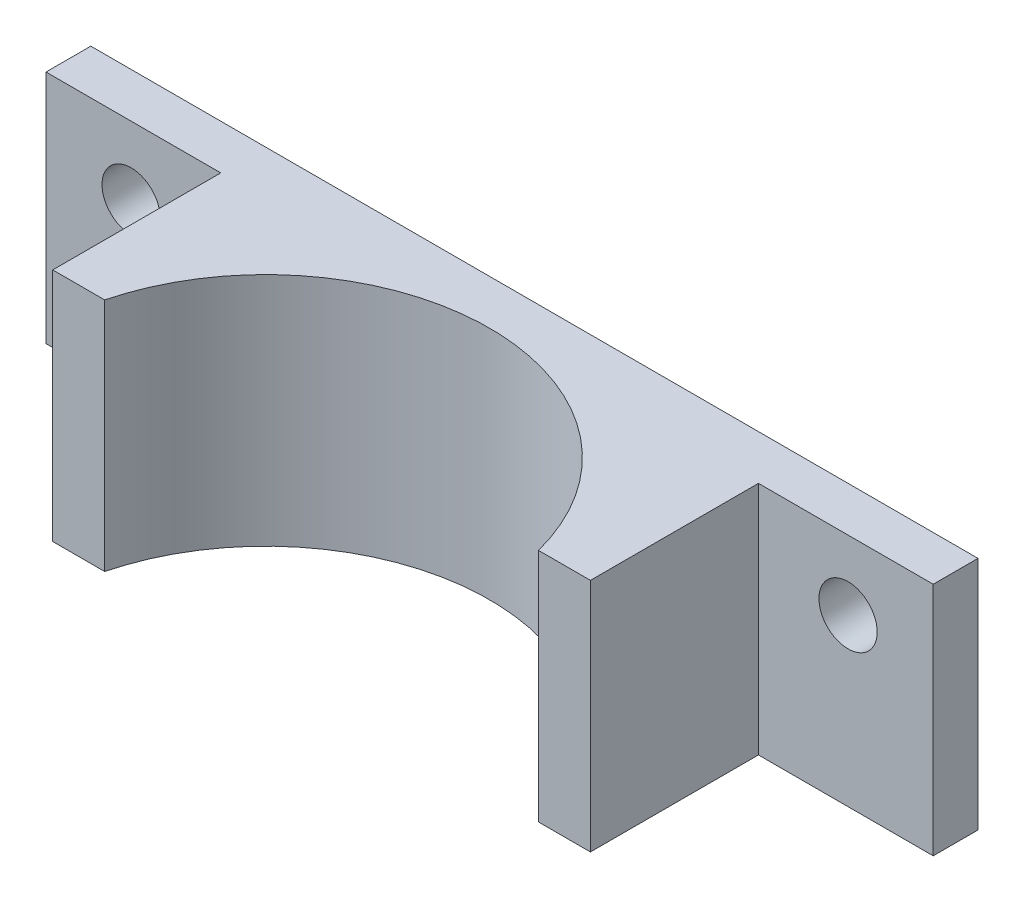
ISO-10303-21;
HEADER;
FILE_DESCRIPTION(('STEP AP214'),'2;1');
FILE_NAME('part.step','',(''),(''),'','','');
FILE_SCHEMA(('AUTOMOTIVE_DESIGN { 1 0 10303 214 1 1 1 1 }'));
ENDSEC;
DATA;
#1=APPLICATION_CONTEXT('core data for automotive mechanical design processes');
#2=APPLICATION_PROTOCOL_DEFINITION('international standard','automotive_design',2000,#1);
#3=PRODUCT_CONTEXT('',#1,'mechanical');
#4=PRODUCT('Part','Part','',(#3));
#5=PRODUCT_RELATED_PRODUCT_CATEGORY('part','',(#4));
#6=PRODUCT_DEFINITION_FORMATION('','',#4);
#7=PRODUCT_DEFINITION_CONTEXT('part definition',#1,'design');
#8=PRODUCT_DEFINITION('design','',#6,#7);
#9=PRODUCT_DEFINITION_SHAPE('','',#8);
#10=(LENGTH_UNIT() NAMED_UNIT(*) SI_UNIT(.MILLI.,.METRE.));
#11=(NAMED_UNIT(*) PLANE_ANGLE_UNIT() SI_UNIT($,.RADIAN.));
#12=(NAMED_UNIT(*) SI_UNIT($,.STERADIAN.) SOLID_ANGLE_UNIT());
#13=UNCERTAINTY_MEASURE_WITH_UNIT(LENGTH_MEASURE(1.E-05),#10,'distance_accuracy_value','');
#14=(GEOMETRIC_REPRESENTATION_CONTEXT(3) GLOBAL_UNCERTAINTY_ASSIGNED_CONTEXT((#13)) GLOBAL_UNIT_ASSIGNED_CONTEXT((#10,
#11,#12)) REPRESENTATION_CONTEXT('',''));
#15=CARTESIAN_POINT('',(0.,0.,0.));
#16=DIRECTION('',(0.,0.,1.));
#17=DIRECTION('',(1.,0.,0.));
#18=AXIS2_PLACEMENT_3D('',#15,#16,#17);
#19=CARTESIAN_POINT('',(0.,0.,24.13));
#20=DIRECTION('',(0.,0.,1.));
#21=DIRECTION('',(1.,0.,0.));
#22=AXIS2_PLACEMENT_3D('',#19,#20,#21);
#23=PLANE('',#22);
#24=DIRECTION('',(-1.,0.,0.));
#25=VECTOR('',#24,1.);
#26=CARTESIAN_POINT('',(0.,1.92935920302377,24.13));
#27=LINE('',#26,#25);
#28=CARTESIAN_POINT('',(-34.5714503107594,1.92935920302377,24.13));
#29=VERTEX_POINT('',#28);
#30=CARTESIAN_POINT('',(-40.4580060623423,1.92935920302377,24.13));
#31=VERTEX_POINT('',#30);
#32=EDGE_CURVE('E222',#29,#31,#27,.T.);
#33=ORIENTED_EDGE('',*,*,#32,.F.);
#34=DIRECTION('',(0.,-1.,0.));
#35=VECTOR('',#34,1.);
#36=CARTESIAN_POINT('',(-34.5714503107594,28.6004092030238,24.13));
#37=LINE('',#36,#35);
#38=CARTESIAN_POINT('',(-34.5714503107594,28.5993592030238,24.13));
#39=VERTEX_POINT('',#38);
#40=EDGE_CURVE('E213',#29,#39,#37,.F.);
#41=ORIENTED_EDGE('',*,*,#40,.T.);
#42=DIRECTION('',(-1.,0.,0.));
#43=VECTOR('',#42,1.);
#44=CARTESIAN_POINT('',(-40.4580060623423,28.5993592030238,24.13));
#45=LINE('',#44,#43);
#46=CARTESIAN_POINT('',(-40.4580060623423,28.5993592030238,24.13));
#47=VERTEX_POINT('',#46);
#48=EDGE_CURVE('E209',#39,#47,#45,.T.);
#49=ORIENTED_EDGE('',*,*,#48,.T.);
#50=DIRECTION('',(0.,-1.,0.));
#51=VECTOR('',#50,1.);
#52=CARTESIAN_POINT('',(-40.4580060623423,28.5993592030238,24.13));
#53=LINE('',#52,#51);
#54=EDGE_CURVE('E203',#47,#31,#53,.T.);
#55=ORIENTED_EDGE('',*,*,#54,.T.);
#56=EDGE_LOOP('',(#33,#41,#49,#55));
#57=FACE_BOUND('',#56,.T.);
#58=ADVANCED_FACE('F33',(#57),#23,.T.);
#59=CARTESIAN_POINT('',(0.,0.,5.08));
#60=DIRECTION('',(0.,0.,1.));
#61=DIRECTION('',(1.,0.,0.));
#62=AXIS2_PLACEMENT_3D('',#59,#60,#61);
#63=PLANE('',#62);
#64=DIRECTION('',(-1.,0.,0.));
#65=VECTOR('',#64,1.);
#66=CARTESIAN_POINT('',(0.,1.92935920302377,5.08));
#67=LINE('',#66,#65);
#68=CARTESIAN_POINT('',(-40.4580060623423,1.92935920302377,5.08));
#69=VERTEX_POINT('',#68);
#70=CARTESIAN_POINT('',(-60.2700060623423,1.92935920302377,5.08));
#71=VERTEX_POINT('',#70);
#72=EDGE_CURVE('E115',#69,#71,#67,.T.);
#73=ORIENTED_EDGE('',*,*,#72,.F.);
#74=DIRECTION('',(0.,-1.,0.));
#75=VECTOR('',#74,1.);
#76=CARTESIAN_POINT('',(-40.4580060623423,28.5993592030238,5.08));
#77=LINE('',#76,#75);
#78=CARTESIAN_POINT('',(-40.4580060623423,28.5993592030238,5.08));
#79=VERTEX_POINT('',#78);
#80=EDGE_CURVE('E57',#79,#69,#77,.T.);
#81=ORIENTED_EDGE('',*,*,#80,.F.);
#82=DIRECTION('',(-1.,0.,0.));
#83=VECTOR('',#82,1.);
#84=CARTESIAN_POINT('',(-60.2700060623423,28.5993592030238,5.08));
#85=LINE('',#84,#83);
#86=CARTESIAN_POINT('',(-60.2700060623423,28.5993592030238,5.08));
#87=VERTEX_POINT('',#86);
#88=EDGE_CURVE('E152',#79,#87,#85,.T.);
#89=ORIENTED_EDGE('',*,*,#88,.T.);
#90=DIRECTION('',(0.,-1.,0.));
#91=VECTOR('',#90,1.);
#92=CARTESIAN_POINT('',(-60.2700060623423,28.5993592030238,5.08));
#93=LINE('',#92,#91);
#94=EDGE_CURVE('E145',#87,#71,#93,.T.);
#95=ORIENTED_EDGE('',*,*,#94,.T.);
#96=EDGE_LOOP('',(#73,#81,#89,#95));
#97=FACE_BOUND('',#96,.T.);
#98=CARTESIAN_POINT('',(-50.6180060623423,20.7253592030238,5.08));
#99=DIRECTION('',(0.,0.,1.));
#100=DIRECTION('',(1.,0.,0.));
#101=AXIS2_PLACEMENT_3D('',#98,#99,#100);
#102=CIRCLE('',#101,3.302);
#103=CARTESIAN_POINT('',(-47.3160060623423,20.7253592030238,5.08));
#104=VERTEX_POINT('',#103);
#105=EDGE_CURVE('E172',#104,#104,#102,.T.);
#106=ORIENTED_EDGE('',*,*,#105,.F.);
#107=EDGE_LOOP('',(#106));
#108=FACE_BOUND('',#107,.T.);
#109=ADVANCED_FACE('F236',(#97,#108),#63,.T.);
#110=DIRECTION('',(-1.,0.,0.));
#111=VECTOR('',#110,1.);
#112=CARTESIAN_POINT('',(0.,1.92935920302377,5.08));
#113=LINE('',#112,#111);
#114=CARTESIAN_POINT('',(40.3139939376577,1.92935920302377,5.08));
#115=VERTEX_POINT('',#114);
#116=CARTESIAN_POINT('',(20.5019939376577,1.92935920302377,5.08));
#117=VERTEX_POINT('',#116);
#118=EDGE_CURVE('E187',#115,#117,#113,.T.);
#119=ORIENTED_EDGE('',*,*,#118,.F.);
#120=DIRECTION('',(0.,1.,0.));
#121=VECTOR('',#120,1.);
#122=CARTESIAN_POINT('',(40.3139939376577,28.5993592030238,5.08));
#123=LINE('',#122,#121);
#124=CARTESIAN_POINT('',(40.3139939376577,28.5993592030238,5.08));
#125=VERTEX_POINT('',#124);
#126=EDGE_CURVE('E154',#115,#125,#123,.T.);
#127=ORIENTED_EDGE('',*,*,#126,.T.);
#128=CARTESIAN_POINT('',(20.5019939376577,28.5993592030238,5.08));
#129=VERTEX_POINT('',#128);
#130=EDGE_CURVE('E147',#125,#129,#85,.T.);
#131=ORIENTED_EDGE('',*,*,#130,.T.);
#132=DIRECTION('',(0.,1.,0.));
#133=VECTOR('',#132,1.);
#134=CARTESIAN_POINT('',(20.5019939376577,28.5993592030238,5.08));
#135=LINE('',#134,#133);
#136=EDGE_CURVE('E37',#117,#129,#135,.T.);
#137=ORIENTED_EDGE('',*,*,#136,.F.);
#138=EDGE_LOOP('',(#119,#127,#131,#137));
#139=FACE_BOUND('',#138,.T.);
#140=CARTESIAN_POINT('',(30.6619939376577,20.7253592030238,5.08));
#141=DIRECTION('',(0.,0.,1.));
#142=DIRECTION('',(1.,0.,0.));
#143=AXIS2_PLACEMENT_3D('',#140,#141,#142);
#144=CIRCLE('',#143,3.302);
#145=CARTESIAN_POINT('',(33.9639939376577,20.7253592030238,5.08));
#146=VERTEX_POINT('',#145);
#147=EDGE_CURVE('E133',#146,#146,#144,.T.);
#148=ORIENTED_EDGE('',*,*,#147,.F.);
#149=EDGE_LOOP('',(#148));
#150=FACE_BOUND('',#149,.T.);
#151=ADVANCED_FACE('F183',(#139,#150),#63,.T.);
#152=CARTESIAN_POINT('',(0.,0.,0.));
#153=DIRECTION('',(0.,0.,1.));
#154=DIRECTION('',(1.,0.,0.));
#155=AXIS2_PLACEMENT_3D('',#152,#153,#154);
#156=PLANE('',#155);
#157=CARTESIAN_POINT('',(-50.6180060623423,20.7253592030238,0.));
#158=DIRECTION('',(0.,0.,1.));
#159=DIRECTION('',(1.,0.,0.));
#160=AXIS2_PLACEMENT_3D('',#157,#158,#159);
#161=CIRCLE('',#160,3.302);
#162=CARTESIAN_POINT('',(-47.3160060623423,20.7253592030238,0.));
#163=VERTEX_POINT('',#162);
#164=EDGE_CURVE('E158',#163,#163,#161,.T.);
#165=ORIENTED_EDGE('',*,*,#164,.T.);
#166=EDGE_LOOP('',(#165));
#167=FACE_BOUND('',#166,.T.);
#168=CARTESIAN_POINT('',(30.6619939376577,20.7253592030238,0.));
#169=DIRECTION('',(0.,0.,1.));
#170=DIRECTION('',(1.,0.,0.));
#171=AXIS2_PLACEMENT_3D('',#168,#169,#170);
#172=CIRCLE('',#171,3.302);
#173=CARTESIAN_POINT('',(33.9639939376577,20.7253592030238,0.));
#174=VERTEX_POINT('',#173);
#175=EDGE_CURVE('E138',#174,#174,#172,.T.);
#176=ORIENTED_EDGE('',*,*,#175,.T.);
#177=EDGE_LOOP('',(#176));
#178=FACE_BOUND('',#177,.T.);
#179=DIRECTION('',(0.,1.,0.));
#180=VECTOR('',#179,1.);
#181=CARTESIAN_POINT('',(40.3139939376577,28.5993592030238,0.));
#182=LINE('',#181,#180);
#183=CARTESIAN_POINT('',(40.3139939376577,1.92935920302377,0.));
#184=VERTEX_POINT('',#183);
#185=CARTESIAN_POINT('',(40.3139939376577,28.5993592030238,0.));
#186=VERTEX_POINT('',#185);
#187=EDGE_CURVE('E128',#184,#186,#182,.T.);
#188=ORIENTED_EDGE('',*,*,#187,.F.);
#189=DIRECTION('',(1.,0.,0.));
#190=VECTOR('',#189,1.);
#191=CARTESIAN_POINT('',(40.3139939376577,1.92935920302377,0.));
#192=LINE('',#191,#190);
#193=CARTESIAN_POINT('',(-60.2700060623423,1.92935920302377,0.));
#194=VERTEX_POINT('',#193);
#195=EDGE_CURVE('E113',#194,#184,#192,.T.);
#196=ORIENTED_EDGE('',*,*,#195,.F.);
#197=DIRECTION('',(0.,-1.,0.));
#198=VECTOR('',#197,1.);
#199=CARTESIAN_POINT('',(-60.2700060623423,28.5993592030238,0.));
#200=LINE('',#199,#198);
#201=CARTESIAN_POINT('',(-60.2700060623423,28.5993592030238,0.));
#202=VERTEX_POINT('',#201);
#203=EDGE_CURVE('E127',#202,#194,#200,.T.);
#204=ORIENTED_EDGE('',*,*,#203,.F.);
#205=DIRECTION('',(-1.,0.,0.));
#206=VECTOR('',#205,1.);
#207=CARTESIAN_POINT('',(-60.2700060623423,28.5993592030238,0.));
#208=LINE('',#207,#206);
#209=EDGE_CURVE('E135',#186,#202,#208,.T.);
#210=ORIENTED_EDGE('',*,*,#209,.F.);
#211=EDGE_LOOP('',(#188,#196,#204,#210));
#212=FACE_BOUND('',#211,.T.);
#213=ADVANCED_FACE('F125',(#167,#178,#212),#156,.F.);
#214=CARTESIAN_POINT('',(-60.2700060623423,28.5993592030238,5.08));
#215=DIRECTION('',(1.,0.,0.));
#216=DIRECTION('',(0.,1.,0.));
#217=AXIS2_PLACEMENT_3D('',#214,#215,#216);
#218=PLANE('',#217);
#219=ORIENTED_EDGE('',*,*,#203,.T.);
#220=DIRECTION('',(0.,0.,-1.));
#221=VECTOR('',#220,1.);
#222=CARTESIAN_POINT('',(-60.2700060623423,1.92935920302377,24.130025));
#223=LINE('',#222,#221);
#224=EDGE_CURVE('E110',#71,#194,#223,.T.);
#225=ORIENTED_EDGE('',*,*,#224,.F.);
#226=ORIENTED_EDGE('',*,*,#94,.F.);
#227=DIRECTION('',(0.,0.,-1.));
#228=VECTOR('',#227,1.);
#229=CARTESIAN_POINT('',(-60.2700060623423,28.5993592030238,5.08));
#230=LINE('',#229,#228);
#231=EDGE_CURVE('E132',#87,#202,#230,.T.);
#232=ORIENTED_EDGE('',*,*,#231,.T.);
#233=EDGE_LOOP('',(#219,#225,#226,#232));
#234=FACE_BOUND('',#233,.T.);
#235=ADVANCED_FACE('F35',(#234),#218,.F.);
#236=CARTESIAN_POINT('',(40.3139939376577,28.5993592030238,5.08));
#237=DIRECTION('',(-1.,0.,0.));
#238=DIRECTION('',(0.,0.,1.));
#239=AXIS2_PLACEMENT_3D('',#236,#237,#238);
#240=PLANE('',#239);
#241=ORIENTED_EDGE('',*,*,#126,.F.);
#242=DIRECTION('',(0.,0.,-1.));
#243=VECTOR('',#242,1.);
#244=CARTESIAN_POINT('',(40.3139939376577,1.92935920302377,24.130025));
#245=LINE('',#244,#243);
#246=EDGE_CURVE('E120',#115,#184,#245,.T.);
#247=ORIENTED_EDGE('',*,*,#246,.T.);
#248=ORIENTED_EDGE('',*,*,#187,.T.);
#249=DIRECTION('',(0.,0.,-1.));
#250=VECTOR('',#249,1.);
#251=CARTESIAN_POINT('',(40.3139939376577,28.5993592030238,5.08));
#252=LINE('',#251,#250);
#253=EDGE_CURVE('E43',#125,#186,#252,.T.);
#254=ORIENTED_EDGE('',*,*,#253,.F.);
#255=EDGE_LOOP('',(#241,#247,#248,#254));
#256=FACE_BOUND('',#255,.T.);
#257=ADVANCED_FACE('F189',(#256),#240,.F.);
#258=CARTESIAN_POINT('',(-60.2700060623423,28.5993592030238,5.08));
#259=DIRECTION('',(0.,-1.,0.));
#260=DIRECTION('',(0.,0.,-1.));
#261=AXIS2_PLACEMENT_3D('',#258,#259,#260);
#262=PLANE('',#261);
#263=ORIENTED_EDGE('',*,*,#48,.F.);
#264=CARTESIAN_POINT('',(-9.9780060623423,28.5993592030238,30.48));
#265=DIRECTION('',(0.,-1.,0.));
#266=DIRECTION('',(0.,0.,-1.));
#267=AXIS2_PLACEMENT_3D('',#264,#265,#266);
#268=CIRCLE('',#267,25.4);
#269=CARTESIAN_POINT('',(14.6154381860748,28.5993592030238,24.13));
#270=VERTEX_POINT('',#269);
#271=EDGE_CURVE('E164',#270,#39,#268,.F.);
#272=ORIENTED_EDGE('',*,*,#271,.F.);
#273=CARTESIAN_POINT('',(20.5019939376577,28.5993592030238,24.13));
#274=VERTEX_POINT('',#273);
#275=EDGE_CURVE('E168',#274,#270,#45,.T.);
#276=ORIENTED_EDGE('',*,*,#275,.F.);
#277=DIRECTION('',(0.,0.,-1.));
#278=VECTOR('',#277,1.);
#279=CARTESIAN_POINT('',(20.5019939376577,28.5993592030238,24.13));
#280=LINE('',#279,#278);
#281=EDGE_CURVE('E155',#274,#129,#280,.T.);
#282=ORIENTED_EDGE('',*,*,#281,.T.);
#283=ORIENTED_EDGE('',*,*,#130,.F.);
#284=ORIENTED_EDGE('',*,*,#253,.T.);
#285=ORIENTED_EDGE('',*,*,#209,.T.);
#286=ORIENTED_EDGE('',*,*,#231,.F.);
#287=ORIENTED_EDGE('',*,*,#88,.F.);
#288=DIRECTION('',(0.,0.,-1.));
#289=VECTOR('',#288,1.);
#290=CARTESIAN_POINT('',(-40.4580060623423,28.5993592030238,24.13));
#291=LINE('',#290,#289);
#292=EDGE_CURVE('E159',#47,#79,#291,.T.);
#293=ORIENTED_EDGE('',*,*,#292,.F.);
#294=EDGE_LOOP('',(#263,#272,#276,#282,#283,#284,#285,#286,#287,#293));
#295=FACE_BOUND('',#294,.T.);
#296=ADVANCED_FACE('F192',(#295),#262,.F.);
#297=CARTESIAN_POINT('',(30.6619939376577,20.7253592030238,5.08));
#298=DIRECTION('',(0.,0.,-1.));
#299=DIRECTION('',(-1.,0.,0.));
#300=AXIS2_PLACEMENT_3D('',#297,#298,#299);
#301=CYLINDRICAL_SURFACE('',#300,3.302);
#302=ORIENTED_EDGE('',*,*,#147,.T.);
#303=EDGE_LOOP('',(#302));
#304=FACE_BOUND('',#303,.T.);
#305=ORIENTED_EDGE('',*,*,#175,.F.);
#306=EDGE_LOOP('',(#305));
#307=FACE_BOUND('',#306,.T.);
#308=ADVANCED_FACE('F245',(#304,#307),#301,.F.);
#309=CARTESIAN_POINT('',(-50.6180060623423,20.7253592030238,5.08));
#310=DIRECTION('',(0.,0.,-1.));
#311=DIRECTION('',(-1.,0.,0.));
#312=AXIS2_PLACEMENT_3D('',#309,#310,#311);
#313=CYLINDRICAL_SURFACE('',#312,3.302);
#314=ORIENTED_EDGE('',*,*,#105,.T.);
#315=EDGE_LOOP('',(#314));
#316=FACE_BOUND('',#315,.T.);
#317=ORIENTED_EDGE('',*,*,#164,.F.);
#318=EDGE_LOOP('',(#317));
#319=FACE_BOUND('',#318,.T.);
#320=ADVANCED_FACE('F242',(#316,#319),#313,.F.);
#321=CARTESIAN_POINT('',(-40.4580060623423,28.5993592030238,24.13));
#322=DIRECTION('',(1.,0.,0.));
#323=DIRECTION('',(0.,1.,0.));
#324=AXIS2_PLACEMENT_3D('',#321,#322,#323);
#325=PLANE('',#324);
#326=ORIENTED_EDGE('',*,*,#80,.T.);
#327=DIRECTION('',(0.,0.,1.));
#328=VECTOR('',#327,1.);
#329=CARTESIAN_POINT('',(-40.4580060623423,1.92935920302377,24.13));
#330=LINE('',#329,#328);
#331=EDGE_CURVE('E219',#69,#31,#330,.T.);
#332=ORIENTED_EDGE('',*,*,#331,.T.);
#333=ORIENTED_EDGE('',*,*,#54,.F.);
#334=ORIENTED_EDGE('',*,*,#292,.T.);
#335=EDGE_LOOP('',(#326,#332,#333,#334));
#336=FACE_BOUND('',#335,.T.);
#337=ADVANCED_FACE('F235',(#336),#325,.F.);
#338=CARTESIAN_POINT('',(20.5019939376577,28.5993592030238,24.13));
#339=DIRECTION('',(-1.,0.,0.));
#340=DIRECTION('',(0.,-1.,0.));
#341=AXIS2_PLACEMENT_3D('',#338,#339,#340);
#342=PLANE('',#341);
#343=DIRECTION('',(0.,1.,0.));
#344=VECTOR('',#343,1.);
#345=CARTESIAN_POINT('',(20.5019939376577,28.5993592030238,24.13));
#346=LINE('',#345,#344);
#347=CARTESIAN_POINT('',(20.5019939376577,1.92935920302377,24.13));
#348=VERTEX_POINT('',#347);
#349=EDGE_CURVE('E201',#348,#274,#346,.T.);
#350=ORIENTED_EDGE('',*,*,#349,.F.);
#351=DIRECTION('',(0.,0.,-1.));
#352=VECTOR('',#351,1.);
#353=CARTESIAN_POINT('',(20.5019939376577,1.92935920302377,24.13));
#354=LINE('',#353,#352);
#355=EDGE_CURVE('E202',#348,#117,#354,.T.);
#356=ORIENTED_EDGE('',*,*,#355,.T.);
#357=ORIENTED_EDGE('',*,*,#136,.T.);
#358=ORIENTED_EDGE('',*,*,#281,.F.);
#359=EDGE_LOOP('',(#350,#356,#357,#358));
#360=FACE_BOUND('',#359,.T.);
#361=ADVANCED_FACE('F199',(#360),#342,.F.);
#362=DIRECTION('',(-1.,0.,0.));
#363=VECTOR('',#362,1.);
#364=CARTESIAN_POINT('',(0.,1.92935920302377,24.13));
#365=LINE('',#364,#363);
#366=CARTESIAN_POINT('',(14.6154381860748,1.92935920302378,24.13));
#367=VERTEX_POINT('',#366);
#368=EDGE_CURVE('E50',#348,#367,#365,.T.);
#369=ORIENTED_EDGE('',*,*,#368,.F.);
#370=ORIENTED_EDGE('',*,*,#349,.T.);
#371=ORIENTED_EDGE('',*,*,#275,.T.);
#372=DIRECTION('',(0.,-1.,0.));
#373=VECTOR('',#372,1.);
#374=CARTESIAN_POINT('',(14.6154381860748,28.6004092030238,24.13));
#375=LINE('',#374,#373);
#376=EDGE_CURVE('E215',#270,#367,#375,.T.);
#377=ORIENTED_EDGE('',*,*,#376,.T.);
#378=EDGE_LOOP('',(#369,#370,#371,#377));
#379=FACE_BOUND('',#378,.T.);
#380=ADVANCED_FACE('F228',(#379),#23,.T.);
#381=CARTESIAN_POINT('',(-9.9780060623423,28.6004092030238,30.48));
#382=DIRECTION('',(0.,-1.,0.));
#383=DIRECTION('',(0.,0.,-1.));
#384=AXIS2_PLACEMENT_3D('',#381,#382,#383);
#385=CYLINDRICAL_SURFACE('',#384,25.4);
#386=ORIENTED_EDGE('',*,*,#40,.F.);
#387=CARTESIAN_POINT('',(-9.9780060623423,1.92935920302377,30.48));
#388=DIRECTION('',(0.,1.,0.));
#389=DIRECTION('',(0.,0.,1.));
#390=AXIS2_PLACEMENT_3D('',#387,#388,#389);
#391=CIRCLE('',#390,25.4);
#392=EDGE_CURVE('E11',#29,#367,#391,.F.);
#393=ORIENTED_EDGE('',*,*,#392,.T.);
#394=ORIENTED_EDGE('',*,*,#376,.F.);
#395=ORIENTED_EDGE('',*,*,#271,.T.);
#396=EDGE_LOOP('',(#386,#393,#394,#395));
#397=FACE_BOUND('',#396,.T.);
#398=ADVANCED_FACE('F231',(#397),#385,.F.);
#399=CARTESIAN_POINT('',(40.3139939376577,1.92935920302377,24.130025));
#400=DIRECTION('',(0.,1.,0.));
#401=DIRECTION('',(0.,0.,1.));
#402=AXIS2_PLACEMENT_3D('',#399,#400,#401);
#403=PLANE('',#402);
#404=ORIENTED_EDGE('',*,*,#72,.T.);
#405=ORIENTED_EDGE('',*,*,#224,.T.);
#406=ORIENTED_EDGE('',*,*,#195,.T.);
#407=ORIENTED_EDGE('',*,*,#246,.F.);
#408=ORIENTED_EDGE('',*,*,#118,.T.);
#409=ORIENTED_EDGE('',*,*,#355,.F.);
#410=ORIENTED_EDGE('',*,*,#368,.T.);
#411=ORIENTED_EDGE('',*,*,#392,.F.);
#412=ORIENTED_EDGE('',*,*,#32,.T.);
#413=ORIENTED_EDGE('',*,*,#331,.F.);
#414=EDGE_LOOP('',(#404,#405,#406,#407,#408,#409,#410,#411,#412,#413));
#415=FACE_BOUND('',#414,.T.);
#416=ADVANCED_FACE('F112',(#415),#403,.F.);
#417=CLOSED_SHELL('',(#58,#109,#151,#213,#235,#257,#296,#308,#320,#337,#361,#380,#398,#416));
#418=MANIFOLD_SOLID_BREP('B2',#417);
#419=ADVANCED_BREP_SHAPE_REPRESENTATION('',(#18,#418),#14);
#420=SHAPE_DEFINITION_REPRESENTATION(#9,#419);
ENDSEC;
END-ISO-10303-21;
